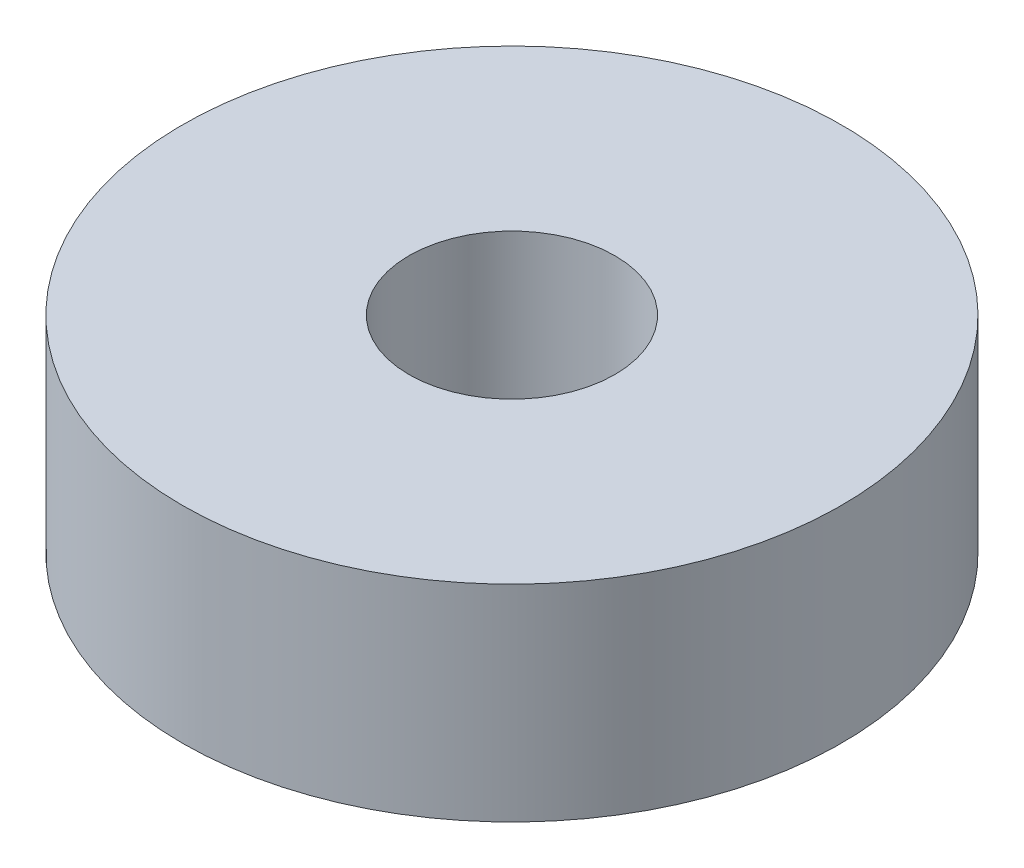
ISO-10303-21;
HEADER;
FILE_DESCRIPTION(('STEP AP214'),'2;1');
FILE_NAME('part.step','',(''),(''),'','','');
FILE_SCHEMA(('AUTOMOTIVE_DESIGN { 1 0 10303 214 1 1 1 1 }'));
ENDSEC;
DATA;
#1=APPLICATION_CONTEXT('core data for automotive mechanical design processes');
#2=APPLICATION_PROTOCOL_DEFINITION('international standard','automotive_design',2000,#1);
#3=PRODUCT_CONTEXT('',#1,'mechanical');
#4=PRODUCT('Part','Part','',(#3));
#5=PRODUCT_RELATED_PRODUCT_CATEGORY('part','',(#4));
#6=PRODUCT_DEFINITION_FORMATION('','',#4);
#7=PRODUCT_DEFINITION_CONTEXT('part definition',#1,'design');
#8=PRODUCT_DEFINITION('design','',#6,#7);
#9=PRODUCT_DEFINITION_SHAPE('','',#8);
#10=(LENGTH_UNIT() NAMED_UNIT(*) SI_UNIT(.MILLI.,.METRE.));
#11=(NAMED_UNIT(*) PLANE_ANGLE_UNIT() SI_UNIT($,.RADIAN.));
#12=(NAMED_UNIT(*) SI_UNIT($,.STERADIAN.) SOLID_ANGLE_UNIT());
#13=UNCERTAINTY_MEASURE_WITH_UNIT(LENGTH_MEASURE(1.E-05),#10,'distance_accuracy_value','');
#14=(GEOMETRIC_REPRESENTATION_CONTEXT(3) GLOBAL_UNCERTAINTY_ASSIGNED_CONTEXT((#13)) GLOBAL_UNIT_ASSIGNED_CONTEXT((#10,
#11,#12)) REPRESENTATION_CONTEXT('',''));
#15=CARTESIAN_POINT('',(0.,0.,0.));
#16=DIRECTION('',(0.,0.,1.));
#17=DIRECTION('',(1.,0.,0.));
#18=AXIS2_PLACEMENT_3D('',#15,#16,#17);
#19=CARTESIAN_POINT('',(0.,5.,0.));
#20=DIRECTION('',(0.,1.,0.));
#21=DIRECTION('',(0.,0.,1.));
#22=AXIS2_PLACEMENT_3D('',#19,#20,#21);
#23=PLANE('',#22);
#24=CARTESIAN_POINT('',(0.,5.,0.));
#25=DIRECTION('',(0.,1.,0.));
#26=DIRECTION('',(0.,0.,1.));
#27=AXIS2_PLACEMENT_3D('',#24,#25,#26);
#28=CIRCLE('',#27,8.);
#29=CARTESIAN_POINT('',(0.,5.,8.));
#30=VERTEX_POINT('',#29);
#31=EDGE_CURVE('E10',#30,#30,#28,.T.);
#32=ORIENTED_EDGE('',*,*,#31,.T.);
#33=EDGE_LOOP('',(#32));
#34=FACE_BOUND('',#33,.T.);
#35=CARTESIAN_POINT('',(0.,5.,0.));
#36=DIRECTION('',(0.,1.,0.));
#37=DIRECTION('',(0.,0.,1.));
#38=AXIS2_PLACEMENT_3D('',#35,#36,#37);
#39=CIRCLE('',#38,2.5);
#40=CARTESIAN_POINT('',(0.,5.,2.5));
#41=VERTEX_POINT('',#40);
#42=EDGE_CURVE('E50',#41,#41,#39,.T.);
#43=ORIENTED_EDGE('',*,*,#42,.F.);
#44=EDGE_LOOP('',(#43));
#45=FACE_BOUND('',#44,.T.);
#46=ADVANCED_FACE('F39',(#34,#45),#23,.T.);
#47=CARTESIAN_POINT('',(0.,0.,0.));
#48=DIRECTION('',(0.,1.,0.));
#49=DIRECTION('',(0.,0.,1.));
#50=AXIS2_PLACEMENT_3D('',#47,#48,#49);
#51=PLANE('',#50);
#52=CARTESIAN_POINT('',(0.,0.,0.));
#53=DIRECTION('',(0.,1.,0.));
#54=DIRECTION('',(0.,0.,1.));
#55=AXIS2_PLACEMENT_3D('',#52,#53,#54);
#56=CIRCLE('',#55,8.);
#57=CARTESIAN_POINT('',(0.,0.,8.));
#58=VERTEX_POINT('',#57);
#59=EDGE_CURVE('E43',#58,#58,#56,.T.);
#60=ORIENTED_EDGE('',*,*,#59,.F.);
#61=EDGE_LOOP('',(#60));
#62=FACE_BOUND('',#61,.T.);
#63=CARTESIAN_POINT('',(0.,0.,0.));
#64=DIRECTION('',(0.,1.,0.));
#65=DIRECTION('',(0.,0.,1.));
#66=AXIS2_PLACEMENT_3D('',#63,#64,#65);
#67=CIRCLE('',#66,2.5);
#68=CARTESIAN_POINT('',(0.,0.,2.5));
#69=VERTEX_POINT('',#68);
#70=EDGE_CURVE('E52',#69,#69,#67,.T.);
#71=ORIENTED_EDGE('',*,*,#70,.T.);
#72=EDGE_LOOP('',(#71));
#73=FACE_BOUND('',#72,.T.);
#74=ADVANCED_FACE('F62',(#62,#73),#51,.F.);
#75=CARTESIAN_POINT('',(0.,5.,0.));
#76=DIRECTION('',(0.,-1.,0.));
#77=DIRECTION('',(0.,0.,-1.));
#78=AXIS2_PLACEMENT_3D('',#75,#76,#77);
#79=CYLINDRICAL_SURFACE('',#78,8.);
#80=ORIENTED_EDGE('',*,*,#31,.F.);
#81=EDGE_LOOP('',(#80));
#82=FACE_BOUND('',#81,.T.);
#83=ORIENTED_EDGE('',*,*,#59,.T.);
#84=EDGE_LOOP('',(#83));
#85=FACE_BOUND('',#84,.T.);
#86=ADVANCED_FACE('F41',(#82,#85),#79,.T.);
#87=CARTESIAN_POINT('',(0.,5.,0.));
#88=DIRECTION('',(0.,-1.,0.));
#89=DIRECTION('',(0.,0.,-1.));
#90=AXIS2_PLACEMENT_3D('',#87,#88,#89);
#91=CYLINDRICAL_SURFACE('',#90,2.5);
#92=ORIENTED_EDGE('',*,*,#42,.T.);
#93=EDGE_LOOP('',(#92));
#94=FACE_BOUND('',#93,.T.);
#95=ORIENTED_EDGE('',*,*,#70,.F.);
#96=EDGE_LOOP('',(#95));
#97=FACE_BOUND('',#96,.T.);
#98=ADVANCED_FACE('F58',(#94,#97),#91,.F.);
#99=CLOSED_SHELL('',(#46,#74,#86,#98));
#100=MANIFOLD_SOLID_BREP('B2',#99);
#101=ADVANCED_BREP_SHAPE_REPRESENTATION('',(#18,#100),#14);
#102=SHAPE_DEFINITION_REPRESENTATION(#9,#101);
ENDSEC;
END-ISO-10303-21;
